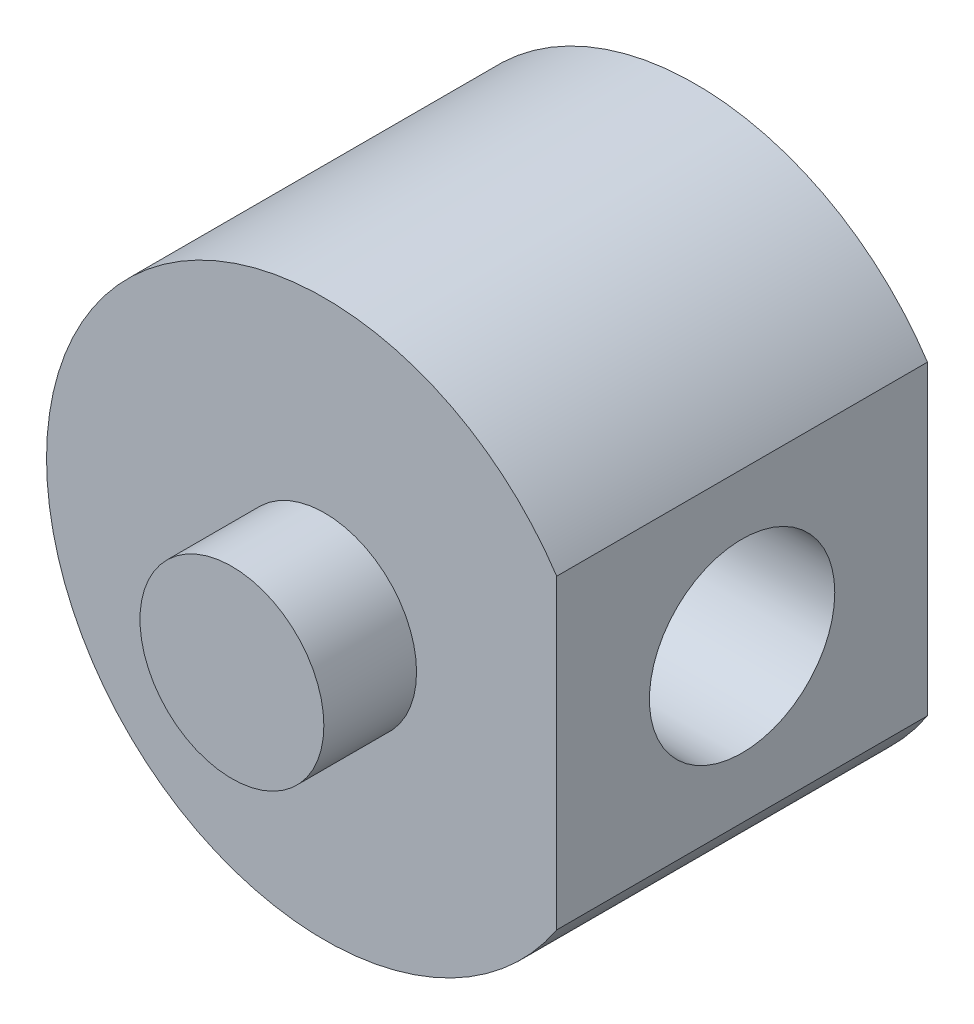
ISO-10303-21;
HEADER;
FILE_DESCRIPTION(('STEP AP214'),'2;1');
FILE_NAME('part.step','',(''),(''),'','','');
FILE_SCHEMA(('AUTOMOTIVE_DESIGN { 1 0 10303 214 1 1 1 1 }'));
ENDSEC;
DATA;
#1=APPLICATION_CONTEXT('core data for automotive mechanical design processes');
#2=APPLICATION_PROTOCOL_DEFINITION('international standard','automotive_design',2000,#1);
#3=PRODUCT_CONTEXT('',#1,'mechanical');
#4=PRODUCT('Part','Part','',(#3));
#5=PRODUCT_RELATED_PRODUCT_CATEGORY('part','',(#4));
#6=PRODUCT_DEFINITION_FORMATION('','',#4);
#7=PRODUCT_DEFINITION_CONTEXT('part definition',#1,'design');
#8=PRODUCT_DEFINITION('design','',#6,#7);
#9=PRODUCT_DEFINITION_SHAPE('','',#8);
#10=(LENGTH_UNIT() NAMED_UNIT(*) SI_UNIT(.MILLI.,.METRE.));
#11=(NAMED_UNIT(*) PLANE_ANGLE_UNIT() SI_UNIT($,.RADIAN.));
#12=(NAMED_UNIT(*) SI_UNIT($,.STERADIAN.) SOLID_ANGLE_UNIT());
#13=UNCERTAINTY_MEASURE_WITH_UNIT(LENGTH_MEASURE(1.E-05),#10,'distance_accuracy_value','');
#14=(GEOMETRIC_REPRESENTATION_CONTEXT(3) GLOBAL_UNCERTAINTY_ASSIGNED_CONTEXT((#13)) GLOBAL_UNIT_ASSIGNED_CONTEXT((#10,
#11,#12)) REPRESENTATION_CONTEXT('',''));
#15=CARTESIAN_POINT('',(0.,0.,0.));
#16=DIRECTION('',(0.,0.,1.));
#17=DIRECTION('',(1.,0.,0.));
#18=AXIS2_PLACEMENT_3D('',#15,#16,#17);
#19=CARTESIAN_POINT('',(-5.12,0.,0.));
#20=DIRECTION('',(1.,0.,0.));
#21=DIRECTION('',(0.,0.,-1.));
#22=AXIS2_PLACEMENT_3D('',#19,#20,#21);
#23=CYLINDRICAL_SURFACE('',#22,1.875);
#24=CARTESIAN_POINT('',(-3.75,0.,-1.875));
#25=CARTESIAN_POINT('',(-3.74999462634452,0.0985724305335627,-1.87499380815527));
#26=CARTESIAN_POINT('',(-3.74607170662043,0.19726237443293,-1.86718111289802));
#27=CARTESIAN_POINT('',(-3.73076542569669,0.39172544112918,-1.83627584935962));
#28=CARTESIAN_POINT('',(-3.71936789679224,0.487492662588055,-1.8131542631291));
#29=CARTESIAN_POINT('',(-3.69030523881329,0.673000396650842,-1.75276160884382));
#30=CARTESIAN_POINT('',(-3.67266448457882,0.762762755510899,-1.71554552953506));
#31=CARTESIAN_POINT('',(-3.63273330967053,0.934636156512372,-1.62830508494065));
#32=CARTESIAN_POINT('',(-3.6104432556286,1.01674780123136,-1.57828172953338));
#33=CARTESIAN_POINT('',(-3.56167984233866,1.17657715830358,-1.46340515721509));
#34=CARTESIAN_POINT('',(-3.53503498364132,1.25372852085395,-1.39783785142568));
#35=CARTESIAN_POINT('',(-3.48112444212643,1.39646145912559,-1.25527222641181));
#36=CARTESIAN_POINT('',(-3.4538583039194,1.46203421832519,-1.17826527792667));
#37=CARTESIAN_POINT('',(-3.39935533495026,1.58484750084427,-1.00784371964366));
#38=CARTESIAN_POINT('',(-3.37228475568997,1.64104750415932,-0.913619815601414));
#39=CARTESIAN_POINT('',(-3.32411210198101,1.73656542542005,-0.715561245025847));
#40=CARTESIAN_POINT('',(-3.30300576763105,1.77589540306188,-0.611733508644845));
#41=CARTESIAN_POINT('',(-3.27108500695891,1.8339983291036,-0.403752927333896));
#42=CARTESIAN_POINT('',(-3.25973009219463,1.85386098202583,-0.299991652373636));
#43=CARTESIAN_POINT('',(-3.24716043653489,1.87580061245409,-0.0900396791634811));
#44=CARTESIAN_POINT('',(-3.24593567518665,1.87789516569951,0.0161485141334148));
#45=CARTESIAN_POINT('',(-3.25332994232341,1.86503866344805,0.214286295591315));
#46=CARTESIAN_POINT('',(-3.26078931866275,1.85209604913154,0.306420058543219));
#47=CARTESIAN_POINT('',(-3.28267928875969,1.81301221698175,0.486978580074454));
#48=CARTESIAN_POINT('',(-3.29711210309581,1.7868667948081,0.575402147447467));
#49=CARTESIAN_POINT('',(-3.33164018273889,1.72164333822376,0.748554623560611));
#50=CARTESIAN_POINT('',(-3.35185951244997,1.68227825084249,0.833149497723354));
#51=CARTESIAN_POINT('',(-3.39568883027632,1.5919531643775,0.994939298606265));
#52=CARTESIAN_POINT('',(-3.41930033962857,1.54098795714838,1.07213087925017));
#53=CARTESIAN_POINT('',(-3.47087171068661,1.42137385296148,1.22722734889355));
#54=CARTESIAN_POINT('',(-3.49900331693899,1.3513021094424,1.30398163795529));
#55=CARTESIAN_POINT('',(-3.55401793688264,1.19916671014008,1.44512890985794));
#56=CARTESIAN_POINT('',(-3.58090034922752,1.11709735607679,1.50951598506353));
#57=CARTESIAN_POINT('',(-3.63191226155557,0.938468448434716,1.62691061443074));
#58=CARTESIAN_POINT('',(-3.65585595303763,0.841412984248892,1.67925088583576));
#59=CARTESIAN_POINT('',(-3.69671027102329,0.638374154041494,1.76643192945564));
#60=CARTESIAN_POINT('',(-3.71362648019162,0.532397955497393,1.80128659690344));
#61=CARTESIAN_POINT('',(-3.73733125765192,0.323937171863818,1.84964138196877));
#62=CARTESIAN_POINT('',(-3.74484259314956,0.221890369778113,1.86467106702522));
#63=CARTESIAN_POINT('',(-3.75136900235819,0.0164617499050353,1.87774637087716));
#64=CARTESIAN_POINT('',(-3.75038810102473,-0.0869194122560781,1.875800035574));
#65=CARTESIAN_POINT('',(-3.7404598547519,-0.283561822473725,1.85586245921486));
#66=CARTESIAN_POINT('',(-3.73213585665316,-0.376986390093618,1.83912650113126));
#67=CARTESIAN_POINT('',(-3.70916571215325,-0.559512923066139,1.79205361519665));
#68=CARTESIAN_POINT('',(-3.69451886877022,-0.648614410670788,1.7617151878997));
#69=CARTESIAN_POINT('',(-3.65970471400477,-0.822916140842948,1.68750287543806));
#70=CARTESIAN_POINT('',(-3.63939153318058,-0.907931994385881,1.64326678103196));
#71=CARTESIAN_POINT('',(-3.59519951845158,-1.06961505318613,1.54292337066269));
#72=CARTESIAN_POINT('',(-3.57131916688009,-1.14627868083111,1.48681099763363));
#73=CARTESIAN_POINT('',(-3.51952915005371,-1.29706441741728,1.35794920250491));
#74=CARTESIAN_POINT('',(-3.49145409081561,-1.37019764591067,1.28410712166535));
#75=CARTESIAN_POINT('',(-3.43616984266537,-1.50348060209785,1.12514034135426));
#76=CARTESIAN_POINT('',(-3.40896126375088,-1.56362134820976,1.04000790216015));
#77=CARTESIAN_POINT('',(-3.35720985387168,-1.67195233964816,0.855668148425671));
#78=CARTESIAN_POINT('',(-3.33285992979489,-1.71942280462546,0.755978876072847));
#79=CARTESIAN_POINT('',(-3.29201385551503,-1.79640529862757,0.548418623296939));
#80=CARTESIAN_POINT('',(-3.27550759165781,-1.82594046725066,0.440558387874581));
#81=CARTESIAN_POINT('',(-3.25427814423379,-1.86349066400039,0.23079333209118));
#82=CARTESIAN_POINT('',(-3.24857593996997,-1.87329936826022,0.129310774808922));
#83=CARTESIAN_POINT('',(-3.24685039953006,-1.87629216445538,-0.0739632509334839));
#84=CARTESIAN_POINT('',(-3.25082286799481,-1.86948346241858,-0.17575456638349));
#85=CARTESIAN_POINT('',(-3.26695991345769,-1.84111148548746,-0.366531565375195));
#86=CARTESIAN_POINT('',(-3.27830802154985,-1.82101558939319,-0.455813381521386));
#87=CARTESIAN_POINT('',(-3.30695655351849,-1.76845379667077,-0.629640223920687));
#88=CARTESIAN_POINT('',(-3.32425889193128,-1.73598392092485,-0.71418371642256));
#89=CARTESIAN_POINT('',(-3.36428494433504,-1.65715452243856,-0.882421595599757));
#90=CARTESIAN_POINT('',(-3.38729479492351,-1.61000838340444,-0.965677315929429));
#91=CARTESIAN_POINT('',(-3.43566246815363,-1.50403307182011,-1.12363975533986));
#92=CARTESIAN_POINT('',(-3.4610215086677,-1.44519782107793,-1.19834199472709));
#93=CARTESIAN_POINT('',(-3.51491855921423,-1.30913123749008,-1.34651621691502));
#94=CARTESIAN_POINT('',(-3.54346843699928,-1.23053329311986,-1.4187358169068));
#95=CARTESIAN_POINT('',(-3.5977078548737,-1.06154026168724,-1.54924309394113));
#96=CARTESIAN_POINT('',(-3.62339584924116,-0.971138856197244,-1.60752326150607));
#97=CARTESIAN_POINT('',(-3.66933767937258,-0.779871743968022,-1.70856818008513));
#98=CARTESIAN_POINT('',(-3.68955180926124,-0.678936569581369,-1.75122031731838));
#99=CARTESIAN_POINT('',(-3.721900149356,-0.470141439633912,-1.81839031454514));
#100=CARTESIAN_POINT('',(-3.73405731305752,-0.362302124229562,-1.84295971276071));
#101=CARTESIAN_POINT('',(-3.74428991087771,-0.211128649670428,-1.86355764578577));
#102=CARTESIAN_POINT('',(-3.7464256001297,-0.169053523952934,-1.86784245162439));
#103=CARTESIAN_POINT('',(-3.74928181831529,-0.0846594971345466,-1.87356499783891));
#104=CARTESIAN_POINT('',(-3.75000230818839,-0.0423405893374283,-1.87500265963164));
#105=CARTESIAN_POINT('',(-3.75,0.,-1.875));
#106=B_SPLINE_CURVE_WITH_KNOTS('',3,(#24,#25,#26,#27,#28,#29,#30,#31,#32,#33,#34,#35,#36,#37,
#38,#39,#40,#41,#42,#43,#44,#45,#46,#47,#48,#49,#50,#51,#52,#53,#54,#55,#56,#57,#58,#59,#60,#61,
#62,#63,#64,#65,#66,#67,#68,#69,#70,#71,#72,#73,#74,#75,#76,#77,#78,#79,#80,#81,#82,#83,#84,#85,
#86,#87,#88,#89,#90,#91,#92,#93,#94,#95,#96,#97,#98,#99,#100,#101,#102,#103,#104,#105),
.UNSPECIFIED.,.T.,.F.,(4,2,2,2,2,2,2,2,2,2,2,2,2,2,2,2,2,2,2,2,2,2,2,2,2,2,2,2,2,2,2,2,2,2,2,2,
2,2,2,2,4),(0.,0.295545482663048,0.591652780704745,0.886616541548059,1.18155705109044,
1.49434079759642,1.80736169560132,2.14465737057661,2.48171152309277,2.7985877276293,
3.11515044991913,3.39385710767476,3.67265257360647,3.95794200315914,4.24335977362916,
4.56496765001022,4.88672877372537,5.22343166652076,5.55986656710524,5.86843669633773,
6.17686058459017,6.46137949698978,6.74592978057996,7.0386160505231,7.33142720153136,
7.65299269958285,7.97477978653934,8.31215029053236,8.6490845989772,8.95367451568212,
9.25813237246272,9.53358619216604,9.80912866478158,10.1031835646304,10.3973917714431,
10.727348301697,11.0574821883984,11.3899502561911,11.7214670366465,11.8484115025109,
11.9753594720825),.UNSPECIFIED.);
#107=CARTESIAN_POINT('',(-3.75,0.,-1.875));
#108=VERTEX_POINT('',#107);
#109=EDGE_CURVE('E132',#108,#108,#106,.T.);
#110=ORIENTED_EDGE('',*,*,#109,.F.);
#111=EDGE_LOOP('',(#110));
#112=FACE_BOUND('',#111,.T.);
#113=CARTESIAN_POINT('',(-1.27,0.,0.));
#114=DIRECTION('',(1.,0.,0.));
#115=DIRECTION('',(0.,0.,-1.));
#116=AXIS2_PLACEMENT_3D('',#113,#114,#115);
#117=CIRCLE('',#116,1.875);
#118=CARTESIAN_POINT('',(-1.27,0.,-1.875));
#119=VERTEX_POINT('',#118);
#120=EDGE_CURVE('E11',#119,#119,#117,.F.);
#121=ORIENTED_EDGE('',*,*,#120,.F.);
#122=EDGE_LOOP('',(#121));
#123=FACE_BOUND('',#122,.T.);
#124=ADVANCED_FACE('F41',(#112,#123),#23,.F.);
#125=CARTESIAN_POINT('',(0.,0.,2.5));
#126=DIRECTION('',(0.,0.,-1.));
#127=DIRECTION('',(-1.,0.,0.));
#128=AXIS2_PLACEMENT_3D('',#125,#126,#127);
#129=CYLINDRICAL_SURFACE('',#128,3.75);
#130=ORIENTED_EDGE('',*,*,#109,.T.);
#131=EDGE_LOOP('',(#130));
#132=FACE_BOUND('',#131,.T.);
#133=CARTESIAN_POINT('',(0.,0.,-2.5));
#134=DIRECTION('',(0.,0.,1.));
#135=DIRECTION('',(1.,0.,0.));
#136=AXIS2_PLACEMENT_3D('',#133,#134,#135);
#137=CIRCLE('',#136,3.75);
#138=CARTESIAN_POINT('',(3.13,2.06533290294809,-2.5));
#139=VERTEX_POINT('',#138);
#140=CARTESIAN_POINT('',(3.13,-2.06533290294809,-2.5));
#141=VERTEX_POINT('',#140);
#142=EDGE_CURVE('E72',#139,#141,#137,.T.);
#143=ORIENTED_EDGE('',*,*,#142,.T.);
#144=DIRECTION('',(0.,0.,-1.));
#145=VECTOR('',#144,1.);
#146=CARTESIAN_POINT('',(3.13,-2.06533290294809,2.5));
#147=LINE('',#146,#145);
#148=CARTESIAN_POINT('',(3.13,-2.06533290294809,2.5));
#149=VERTEX_POINT('',#148);
#150=EDGE_CURVE('E68',#149,#141,#147,.T.);
#151=ORIENTED_EDGE('',*,*,#150,.F.);
#152=CARTESIAN_POINT('',(0.,0.,2.5));
#153=DIRECTION('',(0.,0.,1.));
#154=DIRECTION('',(1.,0.,0.));
#155=AXIS2_PLACEMENT_3D('',#152,#153,#154);
#156=CIRCLE('',#155,3.75);
#157=CARTESIAN_POINT('',(3.13,2.06533290294809,2.5));
#158=VERTEX_POINT('',#157);
#159=EDGE_CURVE('E74',#158,#149,#156,.T.);
#160=ORIENTED_EDGE('',*,*,#159,.F.);
#161=DIRECTION('',(0.,0.,-1.));
#162=VECTOR('',#161,1.);
#163=CARTESIAN_POINT('',(3.13,2.06533290294809,2.5));
#164=LINE('',#163,#162);
#165=EDGE_CURVE('E61',#158,#139,#164,.T.);
#166=ORIENTED_EDGE('',*,*,#165,.T.);
#167=EDGE_LOOP('',(#143,#151,#160,#166));
#168=FACE_BOUND('',#167,.T.);
#169=ADVANCED_FACE('F43',(#132,#168),#129,.T.);
#170=CARTESIAN_POINT('',(3.13,0.,2.5));
#171=DIRECTION('',(1.,0.,0.));
#172=DIRECTION('',(0.,0.,-1.));
#173=AXIS2_PLACEMENT_3D('',#170,#171,#172);
#174=PLANE('',#173);
#175=CARTESIAN_POINT('',(3.13,0.,0.));
#176=DIRECTION('',(1.,0.,0.));
#177=DIRECTION('',(0.,0.,-1.));
#178=AXIS2_PLACEMENT_3D('',#175,#176,#177);
#179=CIRCLE('',#178,1.25);
#180=CARTESIAN_POINT('',(3.13,0.,-1.25));
#181=VERTEX_POINT('',#180);
#182=EDGE_CURVE('E141',#181,#181,#179,.T.);
#183=ORIENTED_EDGE('',*,*,#182,.F.);
#184=EDGE_LOOP('',(#183));
#185=FACE_BOUND('',#184,.T.);
#186=DIRECTION('',(0.,-1.,0.));
#187=VECTOR('',#186,1.);
#188=CARTESIAN_POINT('',(3.13,0.,-2.5));
#189=LINE('',#188,#187);
#190=EDGE_CURVE('E81',#139,#141,#189,.T.);
#191=ORIENTED_EDGE('',*,*,#190,.F.);
#192=ORIENTED_EDGE('',*,*,#165,.F.);
#193=DIRECTION('',(0.,-1.,0.));
#194=VECTOR('',#193,1.);
#195=CARTESIAN_POINT('',(3.13,0.,2.5));
#196=LINE('',#195,#194);
#197=EDGE_CURVE('E77',#158,#149,#196,.T.);
#198=ORIENTED_EDGE('',*,*,#197,.T.);
#199=ORIENTED_EDGE('',*,*,#150,.T.);
#200=EDGE_LOOP('',(#191,#192,#198,#199));
#201=FACE_BOUND('',#200,.T.);
#202=ADVANCED_FACE('F85',(#185,#201),#174,.T.);
#203=CARTESIAN_POINT('',(0.,0.,2.5));
#204=DIRECTION('',(0.,0.,1.));
#205=DIRECTION('',(1.,0.,0.));
#206=AXIS2_PLACEMENT_3D('',#203,#204,#205);
#207=PLANE('',#206);
#208=CARTESIAN_POINT('',(0.,0.,2.5));
#209=DIRECTION('',(0.,0.,1.));
#210=DIRECTION('',(1.,0.,0.));
#211=AXIS2_PLACEMENT_3D('',#208,#209,#210);
#212=CIRCLE('',#211,1.24);
#213=CARTESIAN_POINT('',(1.24,0.,2.5));
#214=VERTEX_POINT('',#213);
#215=EDGE_CURVE('E53',#214,#214,#212,.T.);
#216=ORIENTED_EDGE('',*,*,#215,.F.);
#217=EDGE_LOOP('',(#216));
#218=FACE_BOUND('',#217,.T.);
#219=ORIENTED_EDGE('',*,*,#159,.T.);
#220=ORIENTED_EDGE('',*,*,#197,.F.);
#221=EDGE_LOOP('',(#219,#220));
#222=FACE_BOUND('',#221,.T.);
#223=ADVANCED_FACE('F102',(#218,#222),#207,.T.);
#224=CARTESIAN_POINT('',(0.,0.,-2.5));
#225=DIRECTION('',(0.,0.,1.));
#226=DIRECTION('',(1.,0.,0.));
#227=AXIS2_PLACEMENT_3D('',#224,#225,#226);
#228=PLANE('',#227);
#229=CARTESIAN_POINT('',(0.,0.,-2.5));
#230=DIRECTION('',(0.,0.,1.));
#231=DIRECTION('',(1.,0.,0.));
#232=AXIS2_PLACEMENT_3D('',#229,#230,#231);
#233=CIRCLE('',#232,1.24);
#234=CARTESIAN_POINT('',(1.24,0.,-2.5));
#235=VERTEX_POINT('',#234);
#236=EDGE_CURVE('E140',#235,#235,#233,.T.);
#237=ORIENTED_EDGE('',*,*,#236,.T.);
#238=EDGE_LOOP('',(#237));
#239=FACE_BOUND('',#238,.T.);
#240=ORIENTED_EDGE('',*,*,#142,.F.);
#241=ORIENTED_EDGE('',*,*,#190,.T.);
#242=EDGE_LOOP('',(#240,#241));
#243=FACE_BOUND('',#242,.T.);
#244=ADVANCED_FACE('F80',(#239,#243),#228,.F.);
#245=CARTESIAN_POINT('',(0.,0.,3.75));
#246=DIRECTION('',(0.,0.,-1.));
#247=DIRECTION('',(-1.,0.,0.));
#248=AXIS2_PLACEMENT_3D('',#245,#246,#247);
#249=CYLINDRICAL_SURFACE('',#248,1.24);
#250=CARTESIAN_POINT('',(0.,0.,3.75));
#251=DIRECTION('',(0.,0.,1.));
#252=DIRECTION('',(1.,0.,0.));
#253=AXIS2_PLACEMENT_3D('',#250,#251,#252);
#254=CIRCLE('',#253,1.24);
#255=CARTESIAN_POINT('',(1.24,0.,3.75));
#256=VERTEX_POINT('',#255);
#257=EDGE_CURVE('E83',#256,#256,#254,.T.);
#258=ORIENTED_EDGE('',*,*,#257,.F.);
#259=EDGE_LOOP('',(#258));
#260=FACE_BOUND('',#259,.T.);
#261=ORIENTED_EDGE('',*,*,#215,.T.);
#262=EDGE_LOOP('',(#261));
#263=FACE_BOUND('',#262,.T.);
#264=ADVANCED_FACE('F110',(#260,#263),#249,.T.);
#265=CARTESIAN_POINT('',(0.,0.,3.75));
#266=DIRECTION('',(0.,0.,1.));
#267=DIRECTION('',(1.,0.,0.));
#268=AXIS2_PLACEMENT_3D('',#265,#266,#267);
#269=PLANE('',#268);
#270=ORIENTED_EDGE('',*,*,#257,.T.);
#271=EDGE_LOOP('',(#270));
#272=FACE_BOUND('',#271,.T.);
#273=ADVANCED_FACE('F151',(#272),#269,.T.);
#274=CARTESIAN_POINT('',(0.,0.,-3.75));
#275=DIRECTION('',(0.,0.,1.));
#276=DIRECTION('',(1.,0.,0.));
#277=AXIS2_PLACEMENT_3D('',#274,#275,#276);
#278=CYLINDRICAL_SURFACE('',#277,1.24);
#279=CARTESIAN_POINT('',(0.,0.,-3.75));
#280=DIRECTION('',(0.,0.,1.));
#281=DIRECTION('',(1.,0.,0.));
#282=AXIS2_PLACEMENT_3D('',#279,#280,#281);
#283=CIRCLE('',#282,1.24);
#284=CARTESIAN_POINT('',(1.24,0.,-3.75));
#285=VERTEX_POINT('',#284);
#286=EDGE_CURVE('E142',#285,#285,#283,.T.);
#287=ORIENTED_EDGE('',*,*,#286,.T.);
#288=EDGE_LOOP('',(#287));
#289=FACE_BOUND('',#288,.T.);
#290=ORIENTED_EDGE('',*,*,#236,.F.);
#291=EDGE_LOOP('',(#290));
#292=FACE_BOUND('',#291,.T.);
#293=ADVANCED_FACE('F149',(#289,#292),#278,.T.);
#294=CARTESIAN_POINT('',(0.,0.,-3.75));
#295=DIRECTION('',(0.,0.,-1.));
#296=DIRECTION('',(1.,0.,0.));
#297=AXIS2_PLACEMENT_3D('',#294,#295,#296);
#298=PLANE('',#297);
#299=ORIENTED_EDGE('',*,*,#286,.F.);
#300=EDGE_LOOP('',(#299));
#301=FACE_BOUND('',#300,.T.);
#302=ADVANCED_FACE('F129',(#301),#298,.T.);
#303=CARTESIAN_POINT('',(-1.27,0.,0.));
#304=DIRECTION('',(1.,0.,0.));
#305=DIRECTION('',(0.,0.,-1.));
#306=AXIS2_PLACEMENT_3D('',#303,#304,#305);
#307=PLANE('',#306);
#308=CARTESIAN_POINT('',(-1.27,0.,0.));
#309=DIRECTION('',(1.,0.,0.));
#310=DIRECTION('',(0.,0.,-1.));
#311=AXIS2_PLACEMENT_3D('',#308,#309,#310);
#312=CIRCLE('',#311,1.25);
#313=CARTESIAN_POINT('',(-1.27,0.,-1.25));
#314=VERTEX_POINT('',#313);
#315=EDGE_CURVE('E46',#314,#314,#312,.T.);
#316=ORIENTED_EDGE('',*,*,#315,.T.);
#317=EDGE_LOOP('',(#316));
#318=FACE_BOUND('',#317,.T.);
#319=ORIENTED_EDGE('',*,*,#120,.T.);
#320=EDGE_LOOP('',(#319));
#321=FACE_BOUND('',#320,.T.);
#322=ADVANCED_FACE('F127',(#318,#321),#307,.F.);
#323=CARTESIAN_POINT('',(-3.75,0.,0.));
#324=DIRECTION('',(1.,0.,0.));
#325=DIRECTION('',(0.,0.,-1.));
#326=AXIS2_PLACEMENT_3D('',#323,#324,#325);
#327=CYLINDRICAL_SURFACE('',#326,1.25);
#328=ORIENTED_EDGE('',*,*,#182,.T.);
#329=EDGE_LOOP('',(#328));
#330=FACE_BOUND('',#329,.T.);
#331=ORIENTED_EDGE('',*,*,#315,.F.);
#332=EDGE_LOOP('',(#331));
#333=FACE_BOUND('',#332,.T.);
#334=ADVANCED_FACE('F214',(#330,#333),#327,.F.);
#335=CLOSED_SHELL('',(#124,#169,#202,#223,#244,#264,#273,#293,#302,#322,#334));
#336=MANIFOLD_SOLID_BREP('B2',#335);
#337=ADVANCED_BREP_SHAPE_REPRESENTATION('',(#18,#336),#14);
#338=SHAPE_DEFINITION_REPRESENTATION(#9,#337);
ENDSEC;
END-ISO-10303-21;
